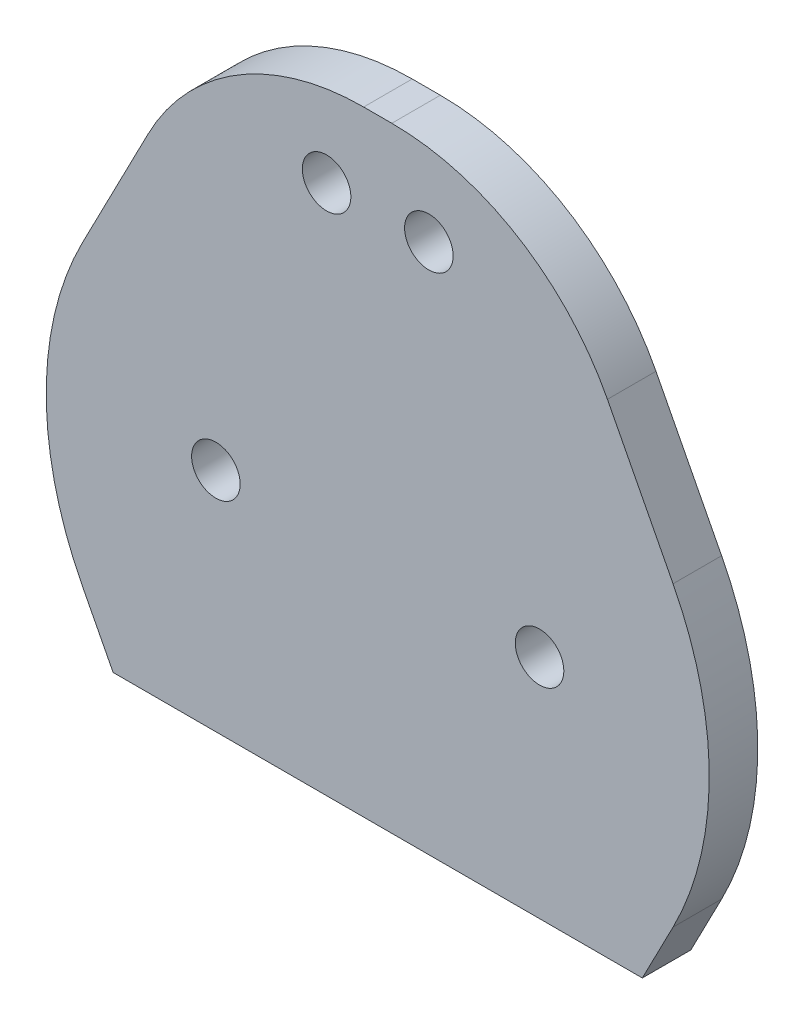
ISO-10303-21;
HEADER;
FILE_DESCRIPTION(('STEP AP214'),'2;1');
FILE_NAME('part.step','',(''),(''),'','','');
FILE_SCHEMA(('AUTOMOTIVE_DESIGN { 1 0 10303 214 1 1 1 1 }'));
ENDSEC;
DATA;
#1=APPLICATION_CONTEXT('core data for automotive mechanical design processes');
#2=APPLICATION_PROTOCOL_DEFINITION('international standard','automotive_design',2000,#1);
#3=PRODUCT_CONTEXT('',#1,'mechanical');
#4=PRODUCT('Part','Part','',(#3));
#5=PRODUCT_RELATED_PRODUCT_CATEGORY('part','',(#4));
#6=PRODUCT_DEFINITION_FORMATION('','',#4);
#7=PRODUCT_DEFINITION_CONTEXT('part definition',#1,'design');
#8=PRODUCT_DEFINITION('design','',#6,#7);
#9=PRODUCT_DEFINITION_SHAPE('','',#8);
#10=(LENGTH_UNIT() NAMED_UNIT(*) SI_UNIT(.MILLI.,.METRE.));
#11=(NAMED_UNIT(*) PLANE_ANGLE_UNIT() SI_UNIT($,.RADIAN.));
#12=(NAMED_UNIT(*) SI_UNIT($,.STERADIAN.) SOLID_ANGLE_UNIT());
#13=UNCERTAINTY_MEASURE_WITH_UNIT(LENGTH_MEASURE(1.E-05),#10,'distance_accuracy_value','');
#14=(GEOMETRIC_REPRESENTATION_CONTEXT(3) GLOBAL_UNCERTAINTY_ASSIGNED_CONTEXT((#13)) GLOBAL_UNIT_ASSIGNED_CONTEXT((#10,
#11,#12)) REPRESENTATION_CONTEXT('',''));
#15=CARTESIAN_POINT('',(0.,0.,0.));
#16=DIRECTION('',(0.,0.,1.));
#17=DIRECTION('',(1.,0.,0.));
#18=AXIS2_PLACEMENT_3D('',#15,#16,#17);
#19=CARTESIAN_POINT('',(0.,0.,3.));
#20=DIRECTION('',(0.,0.,-1.));
#21=DIRECTION('',(-1.,0.,0.));
#22=AXIS2_PLACEMENT_3D('',#19,#20,#21);
#23=PLANE('',#22);
#24=CARTESIAN_POINT('',(-6.84040286651345,18.7938524157181,3.));
#25=DIRECTION('',(0.,0.,1.));
#26=DIRECTION('',(1.,0.,0.));
#27=AXIS2_PLACEMENT_3D('',#24,#25,#26);
#28=CIRCLE('',#27,1.5);
#29=CARTESIAN_POINT('',(-5.34040286651345,18.7938524157181,3.));
#30=VERTEX_POINT('',#29);
#31=EDGE_CURVE('E141',#30,#30,#28,.T.);
#32=ORIENTED_EDGE('',*,*,#31,.F.);
#33=EDGE_LOOP('',(#32));
#34=FACE_BOUND('',#33,.T.);
#35=CARTESIAN_POINT('',(0.,0.,3.));
#36=DIRECTION('',(0.,0.,1.));
#37=DIRECTION('',(1.,0.,0.));
#38=AXIS2_PLACEMENT_3D('',#35,#36,#37);
#39=CIRCLE('',#38,1.5);
#40=CARTESIAN_POINT('',(1.5,0.,3.));
#41=VERTEX_POINT('',#40);
#42=EDGE_CURVE('E208',#41,#41,#39,.T.);
#43=ORIENTED_EDGE('',*,*,#42,.F.);
#44=EDGE_LOOP('',(#43));
#45=FACE_BOUND('',#44,.T.);
#46=CARTESIAN_POINT('',(-20.0008057330269,0.,3.));
#47=DIRECTION('',(0.,0.,1.));
#48=DIRECTION('',(-1.,0.,0.));
#49=AXIS2_PLACEMENT_3D('',#46,#47,#48);
#50=CIRCLE('',#49,1.5);
#51=CARTESIAN_POINT('',(-21.5008057330269,0.,3.));
#52=VERTEX_POINT('',#51);
#53=EDGE_CURVE('E214',#52,#52,#50,.T.);
#54=ORIENTED_EDGE('',*,*,#53,.F.);
#55=EDGE_LOOP('',(#54));
#56=FACE_BOUND('',#55,.T.);
#57=CARTESIAN_POINT('',(-13.1604028665135,18.7938524157181,3.));
#58=DIRECTION('',(0.,0.,1.));
#59=DIRECTION('',(-1.,0.,0.));
#60=AXIS2_PLACEMENT_3D('',#57,#58,#59);
#61=CIRCLE('',#60,1.5);
#62=CARTESIAN_POINT('',(-14.6604028665135,18.7938524157181,3.));
#63=VERTEX_POINT('',#62);
#64=EDGE_CURVE('E222',#63,#63,#61,.T.);
#65=ORIENTED_EDGE('',*,*,#64,.F.);
#66=EDGE_LOOP('',(#65));
#67=FACE_BOUND('',#66,.T.);
#68=DIRECTION('',(-0.459332414669423,-0.888264449831219,0.));
#69=VECTOR('',#68,1.);
#70=CARTESIAN_POINT('',(-25.5728002344343,13.2240078771288,3.));
#71=LINE('',#70,#69);
#72=CARTESIAN_POINT('',(-24.194190215831,15.8899862200413,3.));
#73=VERTEX_POINT('',#72);
#74=CARTESIAN_POINT('',(-28.2498746379857,8.04703811343538,3.));
#75=VERTEX_POINT('',#74);
#76=EDGE_CURVE('E237',#73,#75,#71,.T.);
#77=ORIENTED_EDGE('',*,*,#76,.T.);
#78=CARTESIAN_POINT('',(-10.4845856413614,-1.13961017995307,3.));
#79=DIRECTION('',(0.,0.,-1.));
#80=DIRECTION('',(-1.,0.,0.));
#81=AXIS2_PLACEMENT_3D('',#78,#79,#80);
#82=CIRCLE('',#81,20.);
#83=CARTESIAN_POINT('',(-28.2498746379857,-10.3262584733415,3.));
#84=VERTEX_POINT('',#83);
#85=EDGE_CURVE('E64',#75,#84,#82,.F.);
#86=ORIENTED_EDGE('',*,*,#85,.T.);
#87=DIRECTION('',(0.459332414669423,-0.888264449831219,0.));
#88=VECTOR('',#87,1.);
#89=CARTESIAN_POINT('',(-26.5027418670301,-13.7048920729142,3.));
#90=LINE('',#89,#88);
#91=CARTESIAN_POINT('',(-26.3501379473729,-14.,3.));
#92=VERTEX_POINT('',#91);
#93=EDGE_CURVE('E124',#84,#92,#90,.T.);
#94=ORIENTED_EDGE('',*,*,#93,.T.);
#95=DIRECTION('',(1.,0.,0.));
#96=VECTOR('',#95,1.);
#97=CARTESIAN_POINT('',(12.9995971334865,-14.,3.));
#98=LINE('',#97,#96);
#99=CARTESIAN_POINT('',(6.34933221434602,-14.,3.));
#100=VERTEX_POINT('',#99);
#101=EDGE_CURVE('E131',#92,#100,#98,.T.);
#102=ORIENTED_EDGE('',*,*,#101,.T.);
#103=DIRECTION('',(0.459332414669422,0.888264449831219,0.));
#104=VECTOR('',#103,1.);
#105=CARTESIAN_POINT('',(10.7218314759278,-5.54439023474632,3.));
#106=LINE('',#105,#104);
#107=CARTESIAN_POINT('',(8.24906890495883,-10.3262584733415,3.));
#108=VERTEX_POINT('',#107);
#109=EDGE_CURVE('E238',#100,#108,#106,.T.);
#110=ORIENTED_EDGE('',*,*,#109,.T.);
#111=CARTESIAN_POINT('',(-9.51622009166554,-1.13961017995307,3.));
#112=DIRECTION('',(0.,0.,-1.));
#113=DIRECTION('',(-1.,0.,0.));
#114=AXIS2_PLACEMENT_3D('',#111,#112,#113);
#115=CIRCLE('',#114,20.);
#116=CARTESIAN_POINT('',(8.24906890495883,8.04703811343539,3.));
#117=VERTEX_POINT('',#116);
#118=EDGE_CURVE('E185',#108,#117,#115,.F.);
#119=ORIENTED_EDGE('',*,*,#118,.T.);
#120=DIRECTION('',(-0.459332414669423,0.888264449831219,0.));
#121=VECTOR('',#120,1.);
#122=CARTESIAN_POINT('',(9.7918898433319,5.06350603896088,3.));
#123=LINE('',#122,#121);
#124=CARTESIAN_POINT('',(4.19338448280412,15.8899862200413,3.));
#125=VERTEX_POINT('',#124);
#126=EDGE_CURVE('E133',#117,#125,#123,.T.);
#127=ORIENTED_EDGE('',*,*,#126,.T.);
#128=CARTESIAN_POINT('',(-9.13058226466415,9.,3.));
#129=DIRECTION('',(0.,0.,-1.));
#130=DIRECTION('',(-1.,0.,0.));
#131=AXIS2_PLACEMENT_3D('',#128,#129,#130);
#132=CIRCLE('',#131,15.);
#133=CARTESIAN_POINT('',(-9.13058226466416,24.,3.));
#134=VERTEX_POINT('',#133);
#135=EDGE_CURVE('E158',#125,#134,#132,.F.);
#136=ORIENTED_EDGE('',*,*,#135,.T.);
#137=DIRECTION('',(-1.,0.,0.));
#138=VECTOR('',#137,1.);
#139=CARTESIAN_POINT('',(-33.0004028665135,24.,3.));
#140=LINE('',#139,#138);
#141=CARTESIAN_POINT('',(-10.8702234683628,24.,3.));
#142=VERTEX_POINT('',#141);
#143=EDGE_CURVE('E151',#134,#142,#140,.T.);
#144=ORIENTED_EDGE('',*,*,#143,.T.);
#145=CARTESIAN_POINT('',(-10.8702234683628,9.,3.));
#146=DIRECTION('',(0.,0.,-1.));
#147=DIRECTION('',(-1.,0.,0.));
#148=AXIS2_PLACEMENT_3D('',#145,#146,#147);
#149=CIRCLE('',#148,15.);
#150=EDGE_CURVE('E172',#142,#73,#149,.F.);
#151=ORIENTED_EDGE('',*,*,#150,.T.);
#152=EDGE_LOOP('',(#77,#86,#94,#102,#110,#119,#127,#136,#144,#151));
#153=FACE_BOUND('',#152,.T.);
#154=ADVANCED_FACE('F41',(#34,#45,#56,#67,#153),#23,.F.);
#155=CARTESIAN_POINT('',(0.,0.,0.));
#156=DIRECTION('',(0.,0.,-1.));
#157=DIRECTION('',(-1.,0.,0.));
#158=AXIS2_PLACEMENT_3D('',#155,#156,#157);
#159=PLANE('',#158);
#160=CARTESIAN_POINT('',(-20.0008057330269,0.,0.));
#161=DIRECTION('',(0.,0.,1.));
#162=DIRECTION('',(-1.,0.,0.));
#163=AXIS2_PLACEMENT_3D('',#160,#161,#162);
#164=CIRCLE('',#163,1.5);
#165=CARTESIAN_POINT('',(-21.5008057330269,0.,0.));
#166=VERTEX_POINT('',#165);
#167=EDGE_CURVE('E218',#166,#166,#164,.T.);
#168=ORIENTED_EDGE('',*,*,#167,.T.);
#169=EDGE_LOOP('',(#168));
#170=FACE_BOUND('',#169,.T.);
#171=CARTESIAN_POINT('',(-6.84040286651345,18.7938524157181,0.));
#172=DIRECTION('',(0.,0.,1.));
#173=DIRECTION('',(1.,0.,0.));
#174=AXIS2_PLACEMENT_3D('',#171,#172,#173);
#175=CIRCLE('',#174,1.5);
#176=CARTESIAN_POINT('',(-5.34040286651345,18.7938524157181,0.));
#177=VERTEX_POINT('',#176);
#178=EDGE_CURVE('E148',#177,#177,#175,.T.);
#179=ORIENTED_EDGE('',*,*,#178,.T.);
#180=EDGE_LOOP('',(#179));
#181=FACE_BOUND('',#180,.T.);
#182=CARTESIAN_POINT('',(0.,0.,0.));
#183=DIRECTION('',(0.,0.,1.));
#184=DIRECTION('',(1.,0.,0.));
#185=AXIS2_PLACEMENT_3D('',#182,#183,#184);
#186=CIRCLE('',#185,1.5);
#187=CARTESIAN_POINT('',(1.5,0.,0.));
#188=VERTEX_POINT('',#187);
#189=EDGE_CURVE('E210',#188,#188,#186,.T.);
#190=ORIENTED_EDGE('',*,*,#189,.T.);
#191=EDGE_LOOP('',(#190));
#192=FACE_BOUND('',#191,.T.);
#193=CARTESIAN_POINT('',(-13.1604028665135,18.7938524157181,0.));
#194=DIRECTION('',(0.,0.,1.));
#195=DIRECTION('',(-1.,0.,0.));
#196=AXIS2_PLACEMENT_3D('',#193,#194,#195);
#197=CIRCLE('',#196,1.5);
#198=CARTESIAN_POINT('',(-14.6604028665135,18.7938524157181,0.));
#199=VERTEX_POINT('',#198);
#200=EDGE_CURVE('E226',#199,#199,#197,.T.);
#201=ORIENTED_EDGE('',*,*,#200,.T.);
#202=EDGE_LOOP('',(#201));
#203=FACE_BOUND('',#202,.T.);
#204=DIRECTION('',(0.459332414669423,-0.888264449831219,0.));
#205=VECTOR('',#204,1.);
#206=CARTESIAN_POINT('',(-26.5027418670301,-13.7048920729142,0.));
#207=LINE('',#206,#205);
#208=CARTESIAN_POINT('',(-28.2498746379857,-10.3262584733415,0.));
#209=VERTEX_POINT('',#208);
#210=CARTESIAN_POINT('',(-26.3501379473729,-14.,0.));
#211=VERTEX_POINT('',#210);
#212=EDGE_CURVE('E115',#209,#211,#207,.T.);
#213=ORIENTED_EDGE('',*,*,#212,.F.);
#214=CARTESIAN_POINT('',(-10.4845856413614,-1.13961017995307,0.));
#215=DIRECTION('',(0.,0.,-1.));
#216=DIRECTION('',(-1.,0.,0.));
#217=AXIS2_PLACEMENT_3D('',#214,#215,#216);
#218=CIRCLE('',#217,20.);
#219=CARTESIAN_POINT('',(-28.2498746379857,8.04703811343538,0.));
#220=VERTEX_POINT('',#219);
#221=EDGE_CURVE('E11',#209,#220,#218,.T.);
#222=ORIENTED_EDGE('',*,*,#221,.T.);
#223=DIRECTION('',(-0.459332414669423,-0.888264449831219,0.));
#224=VECTOR('',#223,1.);
#225=CARTESIAN_POINT('',(-25.5728002344343,13.2240078771288,0.));
#226=LINE('',#225,#224);
#227=CARTESIAN_POINT('',(-24.194190215831,15.8899862200413,0.));
#228=VERTEX_POINT('',#227);
#229=EDGE_CURVE('E230',#228,#220,#226,.T.);
#230=ORIENTED_EDGE('',*,*,#229,.F.);
#231=CARTESIAN_POINT('',(-10.8702234683628,9.,0.));
#232=DIRECTION('',(0.,0.,-1.));
#233=DIRECTION('',(-1.,0.,0.));
#234=AXIS2_PLACEMENT_3D('',#231,#232,#233);
#235=CIRCLE('',#234,15.);
#236=CARTESIAN_POINT('',(-10.8702234683628,24.,0.));
#237=VERTEX_POINT('',#236);
#238=EDGE_CURVE('E178',#228,#237,#235,.T.);
#239=ORIENTED_EDGE('',*,*,#238,.T.);
#240=DIRECTION('',(-1.,0.,0.));
#241=VECTOR('',#240,1.);
#242=CARTESIAN_POINT('',(-33.0004028665135,24.,0.));
#243=LINE('',#242,#241);
#244=CARTESIAN_POINT('',(-9.13058226466416,24.,0.));
#245=VERTEX_POINT('',#244);
#246=EDGE_CURVE('E140',#245,#237,#243,.T.);
#247=ORIENTED_EDGE('',*,*,#246,.F.);
#248=CARTESIAN_POINT('',(-9.13058226466415,9.,0.));
#249=DIRECTION('',(0.,0.,-1.));
#250=DIRECTION('',(-1.,0.,0.));
#251=AXIS2_PLACEMENT_3D('',#248,#249,#250);
#252=CIRCLE('',#251,15.);
#253=CARTESIAN_POINT('',(4.19338448280412,15.8899862200413,0.));
#254=VERTEX_POINT('',#253);
#255=EDGE_CURVE('E164',#245,#254,#252,.T.);
#256=ORIENTED_EDGE('',*,*,#255,.T.);
#257=DIRECTION('',(-0.459332414669423,0.888264449831219,0.));
#258=VECTOR('',#257,1.);
#259=CARTESIAN_POINT('',(9.7918898433319,5.06350603896088,0.));
#260=LINE('',#259,#258);
#261=CARTESIAN_POINT('',(8.24906890495883,8.04703811343539,0.));
#262=VERTEX_POINT('',#261);
#263=EDGE_CURVE('E241',#262,#254,#260,.T.);
#264=ORIENTED_EDGE('',*,*,#263,.F.);
#265=CARTESIAN_POINT('',(-9.51622009166554,-1.13961017995307,0.));
#266=DIRECTION('',(0.,0.,-1.));
#267=DIRECTION('',(-1.,0.,0.));
#268=AXIS2_PLACEMENT_3D('',#265,#266,#267);
#269=CIRCLE('',#268,20.);
#270=CARTESIAN_POINT('',(8.24906890495883,-10.3262584733415,0.));
#271=VERTEX_POINT('',#270);
#272=EDGE_CURVE('E191',#262,#271,#269,.T.);
#273=ORIENTED_EDGE('',*,*,#272,.T.);
#274=DIRECTION('',(0.459332414669422,0.888264449831219,0.));
#275=VECTOR('',#274,1.);
#276=CARTESIAN_POINT('',(10.7218314759278,-5.54439023474632,0.));
#277=LINE('',#276,#275);
#278=CARTESIAN_POINT('',(6.34933221434602,-14.,0.));
#279=VERTEX_POINT('',#278);
#280=EDGE_CURVE('E138',#279,#271,#277,.T.);
#281=ORIENTED_EDGE('',*,*,#280,.F.);
#282=DIRECTION('',(1.,0.,0.));
#283=VECTOR('',#282,1.);
#284=CARTESIAN_POINT('',(12.9995971334865,-14.,0.));
#285=LINE('',#284,#283);
#286=EDGE_CURVE('E129',#211,#279,#285,.T.);
#287=ORIENTED_EDGE('',*,*,#286,.F.);
#288=EDGE_LOOP('',(#213,#222,#230,#239,#247,#256,#264,#273,#281,#287));
#289=FACE_BOUND('',#288,.T.);
#290=ADVANCED_FACE('F136',(#170,#181,#192,#203,#289),#159,.T.);
#291=CARTESIAN_POINT('',(12.9995971334865,-14.,3.));
#292=DIRECTION('',(0.,1.,0.));
#293=DIRECTION('',(-1.,0.,0.));
#294=AXIS2_PLACEMENT_3D('',#291,#292,#293);
#295=PLANE('',#294);
#296=DIRECTION('',(0.,0.,1.));
#297=VECTOR('',#296,1.);
#298=CARTESIAN_POINT('',(-26.3501379473729,-14.,0.));
#299=LINE('',#298,#297);
#300=EDGE_CURVE('E118',#211,#92,#299,.T.);
#301=ORIENTED_EDGE('',*,*,#300,.F.);
#302=ORIENTED_EDGE('',*,*,#286,.T.);
#303=DIRECTION('',(0.,0.,1.));
#304=VECTOR('',#303,1.);
#305=CARTESIAN_POINT('',(6.34933221434602,-14.,0.));
#306=LINE('',#305,#304);
#307=EDGE_CURVE('E234',#279,#100,#306,.T.);
#308=ORIENTED_EDGE('',*,*,#307,.T.);
#309=ORIENTED_EDGE('',*,*,#101,.F.);
#310=EDGE_LOOP('',(#301,#302,#308,#309));
#311=FACE_BOUND('',#310,.T.);
#312=ADVANCED_FACE('F127',(#311),#295,.F.);
#313=CARTESIAN_POINT('',(-33.0004028665135,24.,3.));
#314=DIRECTION('',(0.,-1.,0.));
#315=DIRECTION('',(1.,0.,0.));
#316=AXIS2_PLACEMENT_3D('',#313,#314,#315);
#317=PLANE('',#316);
#318=ORIENTED_EDGE('',*,*,#246,.T.);
#319=DIRECTION('',(0.,0.,1.));
#320=VECTOR('',#319,1.);
#321=CARTESIAN_POINT('',(-10.8702234683628,24.,3.));
#322=LINE('',#321,#320);
#323=EDGE_CURVE('E168',#237,#142,#322,.T.);
#324=ORIENTED_EDGE('',*,*,#323,.T.);
#325=ORIENTED_EDGE('',*,*,#143,.F.);
#326=DIRECTION('',(0.,0.,1.));
#327=VECTOR('',#326,1.);
#328=CARTESIAN_POINT('',(-9.13058226466416,24.,0.));
#329=LINE('',#328,#327);
#330=EDGE_CURVE('E161',#134,#245,#329,.F.);
#331=ORIENTED_EDGE('',*,*,#330,.T.);
#332=EDGE_LOOP('',(#318,#324,#325,#331));
#333=FACE_BOUND('',#332,.T.);
#334=ADVANCED_FACE('F269',(#333),#317,.F.);
#335=CARTESIAN_POINT('',(-6.84040286651345,18.7938524157181,3.));
#336=DIRECTION('',(0.,0.,-1.));
#337=DIRECTION('',(-1.,0.,0.));
#338=AXIS2_PLACEMENT_3D('',#335,#336,#337);
#339=CYLINDRICAL_SURFACE('',#338,1.5);
#340=ORIENTED_EDGE('',*,*,#31,.T.);
#341=EDGE_LOOP('',(#340));
#342=FACE_BOUND('',#341,.T.);
#343=ORIENTED_EDGE('',*,*,#178,.F.);
#344=EDGE_LOOP('',(#343));
#345=FACE_BOUND('',#344,.T.);
#346=ADVANCED_FACE('F298',(#342,#345),#339,.F.);
#347=CARTESIAN_POINT('',(0.,0.,3.));
#348=DIRECTION('',(0.,0.,-1.));
#349=DIRECTION('',(-1.,0.,0.));
#350=AXIS2_PLACEMENT_3D('',#347,#348,#349);
#351=CYLINDRICAL_SURFACE('',#350,1.5);
#352=ORIENTED_EDGE('',*,*,#42,.T.);
#353=EDGE_LOOP('',(#352));
#354=FACE_BOUND('',#353,.T.);
#355=ORIENTED_EDGE('',*,*,#189,.F.);
#356=EDGE_LOOP('',(#355));
#357=FACE_BOUND('',#356,.T.);
#358=ADVANCED_FACE('F378',(#354,#357),#351,.F.);
#359=CARTESIAN_POINT('',(-20.0008057330269,0.,3.));
#360=DIRECTION('',(0.,0.,-1.));
#361=DIRECTION('',(-1.,0.,0.));
#362=AXIS2_PLACEMENT_3D('',#359,#360,#361);
#363=CYLINDRICAL_SURFACE('',#362,1.5);
#364=ORIENTED_EDGE('',*,*,#53,.T.);
#365=EDGE_LOOP('',(#364));
#366=FACE_BOUND('',#365,.T.);
#367=ORIENTED_EDGE('',*,*,#167,.F.);
#368=EDGE_LOOP('',(#367));
#369=FACE_BOUND('',#368,.T.);
#370=ADVANCED_FACE('F375',(#366,#369),#363,.F.);
#371=CARTESIAN_POINT('',(-13.1604028665135,18.7938524157181,3.));
#372=DIRECTION('',(0.,0.,-1.));
#373=DIRECTION('',(-1.,0.,0.));
#374=AXIS2_PLACEMENT_3D('',#371,#372,#373);
#375=CYLINDRICAL_SURFACE('',#374,1.5);
#376=ORIENTED_EDGE('',*,*,#64,.T.);
#377=EDGE_LOOP('',(#376));
#378=FACE_BOUND('',#377,.T.);
#379=ORIENTED_EDGE('',*,*,#200,.F.);
#380=EDGE_LOOP('',(#379));
#381=FACE_BOUND('',#380,.T.);
#382=ADVANCED_FACE('F345',(#378,#381),#375,.F.);
#383=CARTESIAN_POINT('',(-25.5728002344343,13.2240078771288,0.));
#384=DIRECTION('',(-0.888264449831219,0.459332414669423,0.));
#385=DIRECTION('',(-0.459332414669423,-0.888264449831219,0.));
#386=AXIS2_PLACEMENT_3D('',#383,#384,#385);
#387=PLANE('',#386);
#388=ORIENTED_EDGE('',*,*,#229,.T.);
#389=DIRECTION('',(0.,0.,1.));
#390=VECTOR('',#389,1.);
#391=CARTESIAN_POINT('',(-28.2498746379857,8.04703811343538,0.));
#392=LINE('',#391,#390);
#393=EDGE_CURVE('E194',#220,#75,#392,.T.);
#394=ORIENTED_EDGE('',*,*,#393,.T.);
#395=ORIENTED_EDGE('',*,*,#76,.F.);
#396=DIRECTION('',(0.,0.,1.));
#397=VECTOR('',#396,1.);
#398=CARTESIAN_POINT('',(-24.194190215831,15.8899862200413,0.));
#399=LINE('',#398,#397);
#400=EDGE_CURVE('E175',#73,#228,#399,.F.);
#401=ORIENTED_EDGE('',*,*,#400,.T.);
#402=EDGE_LOOP('',(#388,#394,#395,#401));
#403=FACE_BOUND('',#402,.T.);
#404=ADVANCED_FACE('F277',(#403),#387,.T.);
#405=CARTESIAN_POINT('',(10.7218314759278,-5.54439023474632,0.));
#406=DIRECTION('',(0.888264449831219,-0.459332414669422,0.));
#407=DIRECTION('',(0.459332414669422,0.888264449831219,0.));
#408=AXIS2_PLACEMENT_3D('',#405,#406,#407);
#409=PLANE('',#408);
#410=ORIENTED_EDGE('',*,*,#280,.T.);
#411=DIRECTION('',(0.,0.,1.));
#412=VECTOR('',#411,1.);
#413=CARTESIAN_POINT('',(8.24906890495883,-10.3262584733415,0.));
#414=LINE('',#413,#412);
#415=EDGE_CURVE('E181',#271,#108,#414,.T.);
#416=ORIENTED_EDGE('',*,*,#415,.T.);
#417=ORIENTED_EDGE('',*,*,#109,.F.);
#418=ORIENTED_EDGE('',*,*,#307,.F.);
#419=EDGE_LOOP('',(#410,#416,#417,#418));
#420=FACE_BOUND('',#419,.T.);
#421=ADVANCED_FACE('F344',(#420),#409,.T.);
#422=CARTESIAN_POINT('',(9.7918898433319,5.06350603896088,0.));
#423=DIRECTION('',(0.888264449831219,0.459332414669423,0.));
#424=DIRECTION('',(-0.459332414669423,0.888264449831219,0.));
#425=AXIS2_PLACEMENT_3D('',#422,#423,#424);
#426=PLANE('',#425);
#427=ORIENTED_EDGE('',*,*,#126,.F.);
#428=DIRECTION('',(0.,0.,1.));
#429=VECTOR('',#428,1.);
#430=CARTESIAN_POINT('',(8.24906890495883,8.04703811343538,0.));
#431=LINE('',#430,#429);
#432=EDGE_CURVE('E188',#117,#262,#431,.F.);
#433=ORIENTED_EDGE('',*,*,#432,.T.);
#434=ORIENTED_EDGE('',*,*,#263,.T.);
#435=DIRECTION('',(0.,0.,1.));
#436=VECTOR('',#435,1.);
#437=CARTESIAN_POINT('',(4.19338448280412,15.8899862200413,3.));
#438=LINE('',#437,#436);
#439=EDGE_CURVE('E154',#254,#125,#438,.T.);
#440=ORIENTED_EDGE('',*,*,#439,.T.);
#441=EDGE_LOOP('',(#427,#433,#434,#440));
#442=FACE_BOUND('',#441,.T.);
#443=ADVANCED_FACE('F257',(#442),#426,.T.);
#444=CARTESIAN_POINT('',(-26.5027418670301,-13.7048920729142,0.));
#445=DIRECTION('',(-0.888264449831219,-0.459332414669423,0.));
#446=DIRECTION('',(0.459332414669423,-0.888264449831219,0.));
#447=AXIS2_PLACEMENT_3D('',#444,#445,#446);
#448=PLANE('',#447);
#449=ORIENTED_EDGE('',*,*,#93,.F.);
#450=DIRECTION('',(0.,0.,1.));
#451=VECTOR('',#450,1.);
#452=CARTESIAN_POINT('',(-28.2498746379857,-10.3262584733415,0.));
#453=LINE('',#452,#451);
#454=EDGE_CURVE('E50',#84,#209,#453,.F.);
#455=ORIENTED_EDGE('',*,*,#454,.T.);
#456=ORIENTED_EDGE('',*,*,#212,.T.);
#457=ORIENTED_EDGE('',*,*,#300,.T.);
#458=EDGE_LOOP('',(#449,#455,#456,#457));
#459=FACE_BOUND('',#458,.T.);
#460=ADVANCED_FACE('F117',(#459),#448,.T.);
#461=CARTESIAN_POINT('',(-9.13058226466415,9.,0.));
#462=DIRECTION('',(0.,0.,-1.));
#463=DIRECTION('',(-1.,0.,0.));
#464=AXIS2_PLACEMENT_3D('',#461,#462,#463);
#465=CYLINDRICAL_SURFACE('',#464,15.);
#466=ORIENTED_EDGE('',*,*,#255,.F.);
#467=ORIENTED_EDGE('',*,*,#330,.F.);
#468=ORIENTED_EDGE('',*,*,#135,.F.);
#469=ORIENTED_EDGE('',*,*,#439,.F.);
#470=EDGE_LOOP('',(#466,#467,#468,#469));
#471=FACE_BOUND('',#470,.T.);
#472=ADVANCED_FACE('F266',(#471),#465,.T.);
#473=CARTESIAN_POINT('',(-10.8702234683628,9.,3.));
#474=DIRECTION('',(0.,0.,-1.));
#475=DIRECTION('',(-1.,0.,0.));
#476=AXIS2_PLACEMENT_3D('',#473,#474,#475);
#477=CYLINDRICAL_SURFACE('',#476,15.);
#478=ORIENTED_EDGE('',*,*,#238,.F.);
#479=ORIENTED_EDGE('',*,*,#400,.F.);
#480=ORIENTED_EDGE('',*,*,#150,.F.);
#481=ORIENTED_EDGE('',*,*,#323,.F.);
#482=EDGE_LOOP('',(#478,#479,#480,#481));
#483=FACE_BOUND('',#482,.T.);
#484=ADVANCED_FACE('F273',(#483),#477,.T.);
#485=CARTESIAN_POINT('',(-9.51622009166554,-1.13961017995307,0.));
#486=DIRECTION('',(0.,0.,1.));
#487=DIRECTION('',(1.,0.,0.));
#488=AXIS2_PLACEMENT_3D('',#485,#486,#487);
#489=CYLINDRICAL_SURFACE('',#488,20.);
#490=ORIENTED_EDGE('',*,*,#272,.F.);
#491=ORIENTED_EDGE('',*,*,#432,.F.);
#492=ORIENTED_EDGE('',*,*,#118,.F.);
#493=ORIENTED_EDGE('',*,*,#415,.F.);
#494=EDGE_LOOP('',(#490,#491,#492,#493));
#495=FACE_BOUND('',#494,.T.);
#496=ADVANCED_FACE('F282',(#495),#489,.T.);
#497=CARTESIAN_POINT('',(-10.4845856413614,-1.13961017995307,0.));
#498=DIRECTION('',(0.,0.,1.));
#499=DIRECTION('',(1.,0.,0.));
#500=AXIS2_PLACEMENT_3D('',#497,#498,#499);
#501=CYLINDRICAL_SURFACE('',#500,20.);
#502=ORIENTED_EDGE('',*,*,#221,.F.);
#503=ORIENTED_EDGE('',*,*,#454,.F.);
#504=ORIENTED_EDGE('',*,*,#85,.F.);
#505=ORIENTED_EDGE('',*,*,#393,.F.);
#506=EDGE_LOOP('',(#502,#503,#504,#505));
#507=FACE_BOUND('',#506,.T.);
#508=ADVANCED_FACE('F43',(#507),#501,.T.);
#509=CLOSED_SHELL('',(#154,#290,#312,#334,#346,#358,#370,#382,#404,#421,#443,#460,#472,#484,
#496,#508));
#510=MANIFOLD_SOLID_BREP('B2',#509);
#511=ADVANCED_BREP_SHAPE_REPRESENTATION('',(#18,#510),#14);
#512=SHAPE_DEFINITION_REPRESENTATION(#9,#511);
ENDSEC;
END-ISO-10303-21;
